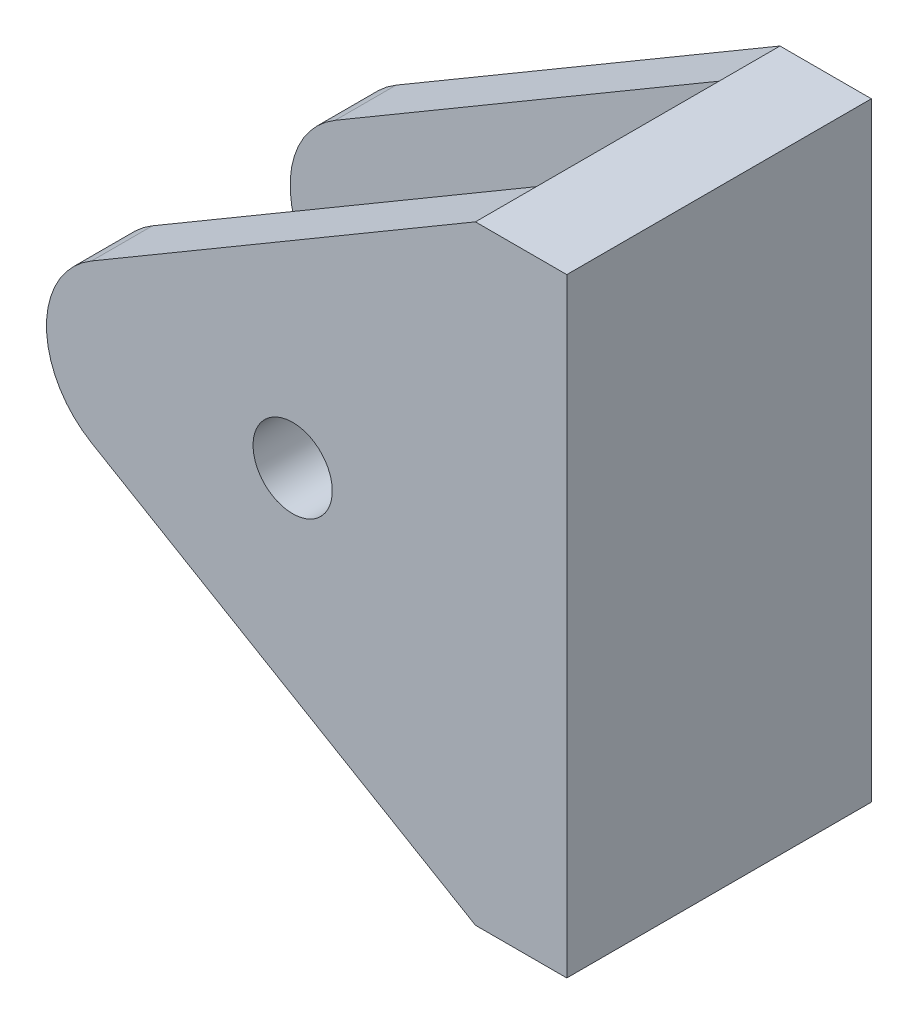
ISO-10303-21;
HEADER;
FILE_DESCRIPTION(('STEP AP214'),'2;1');
FILE_NAME('part.step','',(''),(''),'','','');
FILE_SCHEMA(('AUTOMOTIVE_DESIGN { 1 0 10303 214 1 1 1 1 }'));
ENDSEC;
DATA;
#1=APPLICATION_CONTEXT('core data for automotive mechanical design processes');
#2=APPLICATION_PROTOCOL_DEFINITION('international standard','automotive_design',2000,#1);
#3=PRODUCT_CONTEXT('',#1,'mechanical');
#4=PRODUCT('Part','Part','',(#3));
#5=PRODUCT_RELATED_PRODUCT_CATEGORY('part','',(#4));
#6=PRODUCT_DEFINITION_FORMATION('','',#4);
#7=PRODUCT_DEFINITION_CONTEXT('part definition',#1,'design');
#8=PRODUCT_DEFINITION('design','',#6,#7);
#9=PRODUCT_DEFINITION_SHAPE('','',#8);
#10=(LENGTH_UNIT() NAMED_UNIT(*) SI_UNIT(.MILLI.,.METRE.));
#11=(NAMED_UNIT(*) PLANE_ANGLE_UNIT() SI_UNIT($,.RADIAN.));
#12=(NAMED_UNIT(*) SI_UNIT($,.STERADIAN.) SOLID_ANGLE_UNIT());
#13=UNCERTAINTY_MEASURE_WITH_UNIT(LENGTH_MEASURE(1.E-05),#10,'distance_accuracy_value','');
#14=(GEOMETRIC_REPRESENTATION_CONTEXT(3) GLOBAL_UNCERTAINTY_ASSIGNED_CONTEXT((#13)) GLOBAL_UNIT_ASSIGNED_CONTEXT((#10,
#11,#12)) REPRESENTATION_CONTEXT('',''));
#15=CARTESIAN_POINT('',(0.,0.,0.));
#16=DIRECTION('',(0.,0.,1.));
#17=DIRECTION('',(1.,0.,0.));
#18=AXIS2_PLACEMENT_3D('',#15,#16,#17);
#19=CARTESIAN_POINT('',(-14.0830751230052,0.,0.));
#20=DIRECTION('',(0.,0.,-1.));
#21=DIRECTION('',(-1.,0.,0.));
#22=AXIS2_PLACEMENT_3D('',#19,#20,#21);
#23=PLANE('',#22);
#24=DIRECTION('',(-1.,0.,0.));
#25=VECTOR('',#24,1.);
#26=CARTESIAN_POINT('',(0.,10.,0.));
#27=LINE('',#26,#25);
#28=CARTESIAN_POINT('',(0.,10.,0.));
#29=VERTEX_POINT('',#28);
#30=CARTESIAN_POINT('',(-3.,10.,0.));
#31=VERTEX_POINT('',#30);
#32=EDGE_CURVE('E145',#29,#31,#27,.T.);
#33=ORIENTED_EDGE('',*,*,#32,.F.);
#34=DIRECTION('',(0.,1.,0.));
#35=VECTOR('',#34,1.);
#36=CARTESIAN_POINT('',(0.,-10.,0.));
#37=LINE('',#36,#35);
#38=CARTESIAN_POINT('',(0.,-10.,0.));
#39=VERTEX_POINT('',#38);
#40=EDGE_CURVE('E96',#39,#29,#37,.T.);
#41=ORIENTED_EDGE('',*,*,#40,.F.);
#42=DIRECTION('',(1.,0.,0.));
#43=VECTOR('',#42,1.);
#44=CARTESIAN_POINT('',(0.,-10.,0.));
#45=LINE('',#44,#43);
#46=CARTESIAN_POINT('',(-3.,-10.,0.));
#47=VERTEX_POINT('',#46);
#48=EDGE_CURVE('E158',#47,#39,#45,.T.);
#49=ORIENTED_EDGE('',*,*,#48,.F.);
#50=DIRECTION('',(0.86193421515777,-0.507020126563394,0.));
#51=VECTOR('',#50,1.);
#52=CARTESIAN_POINT('',(-3.,-10.,0.));
#53=LINE('',#52,#51);
#54=CARTESIAN_POINT('',(-15.6041355026954,-2.58580264547331,0.));
#55=VERTEX_POINT('',#54);
#56=EDGE_CURVE('E155',#55,#47,#53,.T.);
#57=ORIENTED_EDGE('',*,*,#56,.F.);
#58=CARTESIAN_POINT('',(-14.0830751230052,0.,0.));
#59=DIRECTION('',(0.,0.,1.));
#60=DIRECTION('',(-1.,0.,0.));
#61=AXIS2_PLACEMENT_3D('',#58,#59,#60);
#62=CIRCLE('',#61,3.);
#63=CARTESIAN_POINT('',(-15.6041355026954,2.58580264547331,0.));
#64=VERTEX_POINT('',#63);
#65=EDGE_CURVE('E152',#64,#55,#62,.T.);
#66=ORIENTED_EDGE('',*,*,#65,.F.);
#67=DIRECTION('',(-0.86193421515777,-0.507020126563394,0.));
#68=VECTOR('',#67,1.);
#69=CARTESIAN_POINT('',(-3.,10.,0.));
#70=LINE('',#69,#68);
#71=EDGE_CURVE('E148',#31,#64,#70,.T.);
#72=ORIENTED_EDGE('',*,*,#71,.F.);
#73=EDGE_LOOP('',(#33,#41,#49,#57,#66,#72));
#74=FACE_BOUND('',#73,.T.);
#75=CARTESIAN_POINT('',(-9.,0.,0.));
#76=DIRECTION('',(0.,0.,-1.));
#77=DIRECTION('',(-1.,0.,0.));
#78=AXIS2_PLACEMENT_3D('',#75,#76,#77);
#79=CIRCLE('',#78,1.29999999999999);
#80=CARTESIAN_POINT('',(-10.3,0.,0.));
#81=VERTEX_POINT('',#80);
#82=EDGE_CURVE('E272',#81,#81,#79,.F.);
#83=ORIENTED_EDGE('',*,*,#82,.T.);
#84=EDGE_LOOP('',(#83));
#85=FACE_BOUND('',#84,.T.);
#86=ADVANCED_FACE('F45',(#74,#85),#23,.T.);
#87=CARTESIAN_POINT('',(-3.,10.,10.));
#88=DIRECTION('',(0.507020126563394,-0.861934215157769,0.));
#89=DIRECTION('',(0.86193421515777,0.507020126563394,0.));
#90=AXIS2_PLACEMENT_3D('',#87,#88,#89);
#91=PLANE('',#90);
#92=DIRECTION('',(-0.86193421515777,-0.507020126563394,0.));
#93=VECTOR('',#92,1.);
#94=CARTESIAN_POINT('',(-3.,10.,2.));
#95=LINE('',#94,#93);
#96=CARTESIAN_POINT('',(-3.00000000000001,10.,2.));
#97=VERTEX_POINT('',#96);
#98=CARTESIAN_POINT('',(-15.6041355026954,2.58580264547331,2.));
#99=VERTEX_POINT('',#98);
#100=EDGE_CURVE('E149',#97,#99,#95,.T.);
#101=ORIENTED_EDGE('',*,*,#100,.F.);
#102=DIRECTION('',(0.,0.,-1.));
#103=VECTOR('',#102,1.);
#104=CARTESIAN_POINT('',(-3.,10.,10.));
#105=LINE('',#104,#103);
#106=EDGE_CURVE('E170',#97,#31,#105,.T.);
#107=ORIENTED_EDGE('',*,*,#106,.T.);
#108=ORIENTED_EDGE('',*,*,#71,.T.);
#109=DIRECTION('',(0.,0.,-1.));
#110=VECTOR('',#109,1.);
#111=CARTESIAN_POINT('',(-15.6041355026954,2.58580264547331,10.));
#112=LINE('',#111,#110);
#113=EDGE_CURVE('E166',#99,#64,#112,.T.);
#114=ORIENTED_EDGE('',*,*,#113,.F.);
#115=EDGE_LOOP('',(#101,#107,#108,#114));
#116=FACE_BOUND('',#115,.T.);
#117=ADVANCED_FACE('F218',(#116),#91,.F.);
#118=DIRECTION('',(0.86193421515777,0.507020126563394,0.));
#119=VECTOR('',#118,1.);
#120=CARTESIAN_POINT('',(-3.,10.,8.));
#121=LINE('',#120,#119);
#122=CARTESIAN_POINT('',(-15.6041355026954,2.58580264547331,8.));
#123=VERTEX_POINT('',#122);
#124=CARTESIAN_POINT('',(-3.00000000000001,10.,8.));
#125=VERTEX_POINT('',#124);
#126=EDGE_CURVE('E188',#123,#125,#121,.T.);
#127=ORIENTED_EDGE('',*,*,#126,.F.);
#128=CARTESIAN_POINT('',(-15.6041355026954,2.58580264547331,10.));
#129=VERTEX_POINT('',#128);
#130=EDGE_CURVE('E167',#129,#123,#112,.T.);
#131=ORIENTED_EDGE('',*,*,#130,.F.);
#132=DIRECTION('',(-0.86193421515777,-0.507020126563394,0.));
#133=VECTOR('',#132,1.);
#134=CARTESIAN_POINT('',(-3.,10.,10.));
#135=LINE('',#134,#133);
#136=CARTESIAN_POINT('',(-3.,10.,10.));
#137=VERTEX_POINT('',#136);
#138=EDGE_CURVE('E105',#137,#129,#135,.T.);
#139=ORIENTED_EDGE('',*,*,#138,.F.);
#140=EDGE_CURVE('E171',#137,#125,#105,.T.);
#141=ORIENTED_EDGE('',*,*,#140,.T.);
#142=EDGE_LOOP('',(#127,#131,#139,#141));
#143=FACE_BOUND('',#142,.T.);
#144=ADVANCED_FACE('F204',(#143),#91,.F.);
#145=CARTESIAN_POINT('',(-14.0830751230052,0.,10.));
#146=DIRECTION('',(0.,0.,-1.));
#147=DIRECTION('',(-1.,0.,0.));
#148=AXIS2_PLACEMENT_3D('',#145,#146,#147);
#149=CYLINDRICAL_SURFACE('',#148,3.);
#150=CARTESIAN_POINT('',(-14.0830751230052,0.,2.));
#151=DIRECTION('',(0.,0.,1.));
#152=DIRECTION('',(0.,-1.,0.));
#153=AXIS2_PLACEMENT_3D('',#150,#151,#152);
#154=CIRCLE('',#153,3.);
#155=CARTESIAN_POINT('',(-15.6041355026954,-2.58580264547331,2.));
#156=VERTEX_POINT('',#155);
#157=EDGE_CURVE('E191',#99,#156,#154,.T.);
#158=ORIENTED_EDGE('',*,*,#157,.F.);
#159=ORIENTED_EDGE('',*,*,#113,.T.);
#160=ORIENTED_EDGE('',*,*,#65,.T.);
#161=DIRECTION('',(0.,0.,-1.));
#162=VECTOR('',#161,1.);
#163=CARTESIAN_POINT('',(-15.6041355026954,-2.58580264547331,10.));
#164=LINE('',#163,#162);
#165=EDGE_CURVE('E134',#156,#55,#164,.T.);
#166=ORIENTED_EDGE('',*,*,#165,.F.);
#167=EDGE_LOOP('',(#158,#159,#160,#166));
#168=FACE_BOUND('',#167,.T.);
#169=ADVANCED_FACE('F228',(#168),#149,.T.);
#170=CARTESIAN_POINT('',(-14.0830751230052,0.,8.));
#171=DIRECTION('',(0.,0.,-1.));
#172=DIRECTION('',(0.,1.,0.));
#173=AXIS2_PLACEMENT_3D('',#170,#171,#172);
#174=CIRCLE('',#173,3.);
#175=CARTESIAN_POINT('',(-15.6041355026954,-2.58580264547331,8.));
#176=VERTEX_POINT('',#175);
#177=EDGE_CURVE('E181',#176,#123,#174,.T.);
#178=ORIENTED_EDGE('',*,*,#177,.F.);
#179=CARTESIAN_POINT('',(-15.6041355026954,-2.58580264547331,10.));
#180=VERTEX_POINT('',#179);
#181=EDGE_CURVE('E164',#180,#176,#164,.T.);
#182=ORIENTED_EDGE('',*,*,#181,.F.);
#183=CARTESIAN_POINT('',(-14.0830751230052,0.,10.));
#184=DIRECTION('',(0.,0.,1.));
#185=DIRECTION('',(-1.,0.,0.));
#186=AXIS2_PLACEMENT_3D('',#183,#184,#185);
#187=CIRCLE('',#186,3.);
#188=EDGE_CURVE('E121',#129,#180,#187,.T.);
#189=ORIENTED_EDGE('',*,*,#188,.F.);
#190=ORIENTED_EDGE('',*,*,#130,.T.);
#191=EDGE_LOOP('',(#178,#182,#189,#190));
#192=FACE_BOUND('',#191,.T.);
#193=ADVANCED_FACE('F187',(#192),#149,.T.);
#194=CARTESIAN_POINT('',(-3.,-10.,10.));
#195=DIRECTION('',(0.507020126563394,0.861934215157769,0.));
#196=DIRECTION('',(-0.86193421515777,0.507020126563394,0.));
#197=AXIS2_PLACEMENT_3D('',#194,#195,#196);
#198=PLANE('',#197);
#199=DIRECTION('',(0.86193421515777,-0.507020126563394,0.));
#200=VECTOR('',#199,1.);
#201=CARTESIAN_POINT('',(-3.,-10.,2.));
#202=LINE('',#201,#200);
#203=CARTESIAN_POINT('',(-3.,-10.,2.));
#204=VERTEX_POINT('',#203);
#205=EDGE_CURVE('E11',#156,#204,#202,.T.);
#206=ORIENTED_EDGE('',*,*,#205,.F.);
#207=ORIENTED_EDGE('',*,*,#165,.T.);
#208=ORIENTED_EDGE('',*,*,#56,.T.);
#209=DIRECTION('',(0.,0.,-1.));
#210=VECTOR('',#209,1.);
#211=CARTESIAN_POINT('',(-3.,-10.,10.));
#212=LINE('',#211,#210);
#213=EDGE_CURVE('E137',#204,#47,#212,.T.);
#214=ORIENTED_EDGE('',*,*,#213,.F.);
#215=EDGE_LOOP('',(#206,#207,#208,#214));
#216=FACE_BOUND('',#215,.T.);
#217=ADVANCED_FACE('F235',(#216),#198,.F.);
#218=DIRECTION('',(-0.86193421515777,0.507020126563394,0.));
#219=VECTOR('',#218,1.);
#220=CARTESIAN_POINT('',(-3.,-10.,8.));
#221=LINE('',#220,#219);
#222=CARTESIAN_POINT('',(-3.,-10.,8.));
#223=VERTEX_POINT('',#222);
#224=EDGE_CURVE('E54',#223,#176,#221,.T.);
#225=ORIENTED_EDGE('',*,*,#224,.F.);
#226=CARTESIAN_POINT('',(-3.,-10.,10.));
#227=VERTEX_POINT('',#226);
#228=EDGE_CURVE('E128',#227,#223,#212,.T.);
#229=ORIENTED_EDGE('',*,*,#228,.F.);
#230=DIRECTION('',(0.86193421515777,-0.507020126563394,0.));
#231=VECTOR('',#230,1.);
#232=CARTESIAN_POINT('',(-3.,-10.,10.));
#233=LINE('',#232,#231);
#234=EDGE_CURVE('E114',#180,#227,#233,.T.);
#235=ORIENTED_EDGE('',*,*,#234,.F.);
#236=ORIENTED_EDGE('',*,*,#181,.T.);
#237=EDGE_LOOP('',(#225,#229,#235,#236));
#238=FACE_BOUND('',#237,.T.);
#239=ADVANCED_FACE('F129',(#238),#198,.F.);
#240=CARTESIAN_POINT('',(0.,10.,10.));
#241=DIRECTION('',(0.,-1.,0.));
#242=DIRECTION('',(0.,0.,-1.));
#243=AXIS2_PLACEMENT_3D('',#240,#241,#242);
#244=PLANE('',#243);
#245=ORIENTED_EDGE('',*,*,#32,.T.);
#246=ORIENTED_EDGE('',*,*,#106,.F.);
#247=DIRECTION('',(0.,0.,1.));
#248=VECTOR('',#247,1.);
#249=CARTESIAN_POINT('',(-3.,10.,10.));
#250=LINE('',#249,#248);
#251=EDGE_CURVE('E189',#97,#125,#250,.T.);
#252=ORIENTED_EDGE('',*,*,#251,.T.);
#253=ORIENTED_EDGE('',*,*,#140,.F.);
#254=DIRECTION('',(-1.,0.,0.));
#255=VECTOR('',#254,1.);
#256=CARTESIAN_POINT('',(0.,10.,10.));
#257=LINE('',#256,#255);
#258=CARTESIAN_POINT('',(0.,10.,10.));
#259=VERTEX_POINT('',#258);
#260=EDGE_CURVE('E161',#259,#137,#257,.T.);
#261=ORIENTED_EDGE('',*,*,#260,.F.);
#262=DIRECTION('',(0.,0.,-1.));
#263=VECTOR('',#262,1.);
#264=CARTESIAN_POINT('',(0.,10.,10.));
#265=LINE('',#264,#263);
#266=EDGE_CURVE('E141',#259,#29,#265,.T.);
#267=ORIENTED_EDGE('',*,*,#266,.T.);
#268=EDGE_LOOP('',(#245,#246,#252,#253,#261,#267));
#269=FACE_BOUND('',#268,.T.);
#270=ADVANCED_FACE('F47',(#269),#244,.F.);
#271=CARTESIAN_POINT('',(0.,-10.,10.));
#272=DIRECTION('',(0.,1.,0.));
#273=DIRECTION('',(0.,0.,1.));
#274=AXIS2_PLACEMENT_3D('',#271,#272,#273);
#275=PLANE('',#274);
#276=ORIENTED_EDGE('',*,*,#48,.T.);
#277=DIRECTION('',(0.,0.,-1.));
#278=VECTOR('',#277,1.);
#279=CARTESIAN_POINT('',(0.,-10.,10.));
#280=LINE('',#279,#278);
#281=CARTESIAN_POINT('',(0.,-10.,10.));
#282=VERTEX_POINT('',#281);
#283=EDGE_CURVE('E139',#282,#39,#280,.T.);
#284=ORIENTED_EDGE('',*,*,#283,.F.);
#285=DIRECTION('',(1.,0.,0.));
#286=VECTOR('',#285,1.);
#287=CARTESIAN_POINT('',(0.,-10.,10.));
#288=LINE('',#287,#286);
#289=EDGE_CURVE('E118',#227,#282,#288,.T.);
#290=ORIENTED_EDGE('',*,*,#289,.F.);
#291=ORIENTED_EDGE('',*,*,#228,.T.);
#292=EDGE_CURVE('E135',#223,#204,#212,.T.);
#293=ORIENTED_EDGE('',*,*,#292,.T.);
#294=ORIENTED_EDGE('',*,*,#213,.T.);
#295=EDGE_LOOP('',(#276,#284,#290,#291,#293,#294));
#296=FACE_BOUND('',#295,.T.);
#297=ADVANCED_FACE('F138',(#296),#275,.F.);
#298=CARTESIAN_POINT('',(0.,-10.,10.));
#299=DIRECTION('',(-1.,0.,0.));
#300=DIRECTION('',(0.,-1.,0.));
#301=AXIS2_PLACEMENT_3D('',#298,#299,#300);
#302=PLANE('',#301);
#303=ORIENTED_EDGE('',*,*,#40,.T.);
#304=ORIENTED_EDGE('',*,*,#266,.F.);
#305=DIRECTION('',(0.,1.,0.));
#306=VECTOR('',#305,1.);
#307=CARTESIAN_POINT('',(0.,-10.,10.));
#308=LINE('',#307,#306);
#309=EDGE_CURVE('E69',#282,#259,#308,.T.);
#310=ORIENTED_EDGE('',*,*,#309,.F.);
#311=ORIENTED_EDGE('',*,*,#283,.T.);
#312=EDGE_LOOP('',(#303,#304,#310,#311));
#313=FACE_BOUND('',#312,.T.);
#314=ADVANCED_FACE('F236',(#313),#302,.F.);
#315=CARTESIAN_POINT('',(-14.0830751230052,0.,10.));
#316=DIRECTION('',(0.,0.,-1.));
#317=DIRECTION('',(-1.,0.,0.));
#318=AXIS2_PLACEMENT_3D('',#315,#316,#317);
#319=PLANE('',#318);
#320=CARTESIAN_POINT('',(-9.,0.,10.));
#321=DIRECTION('',(0.,0.,1.));
#322=DIRECTION('',(1.,0.,0.));
#323=AXIS2_PLACEMENT_3D('',#320,#321,#322);
#324=CIRCLE('',#323,1.29999999999999);
#325=CARTESIAN_POINT('',(-7.70000000000001,0.,10.));
#326=VERTEX_POINT('',#325);
#327=EDGE_CURVE('E271',#326,#326,#324,.T.);
#328=ORIENTED_EDGE('',*,*,#327,.F.);
#329=EDGE_LOOP('',(#328));
#330=FACE_BOUND('',#329,.T.);
#331=ORIENTED_EDGE('',*,*,#260,.T.);
#332=ORIENTED_EDGE('',*,*,#138,.T.);
#333=ORIENTED_EDGE('',*,*,#188,.T.);
#334=ORIENTED_EDGE('',*,*,#234,.T.);
#335=ORIENTED_EDGE('',*,*,#289,.T.);
#336=ORIENTED_EDGE('',*,*,#309,.T.);
#337=EDGE_LOOP('',(#331,#332,#333,#334,#335,#336));
#338=FACE_BOUND('',#337,.T.);
#339=ADVANCED_FACE('F116',(#330,#338),#319,.F.);
#340=CARTESIAN_POINT('',(-3.00000000000001,12.456927681102,2.));
#341=DIRECTION('',(0.,0.,1.));
#342=DIRECTION('',(0.,-1.,0.));
#343=AXIS2_PLACEMENT_3D('',#340,#341,#342);
#344=PLANE('',#343);
#345=CARTESIAN_POINT('',(-9.,0.,2.));
#346=DIRECTION('',(0.,0.,1.));
#347=DIRECTION('',(0.,-1.,0.));
#348=AXIS2_PLACEMENT_3D('',#345,#346,#347);
#349=CIRCLE('',#348,1.29999999999999);
#350=CARTESIAN_POINT('',(-9.,-1.29999999999999,2.));
#351=VERTEX_POINT('',#350);
#352=EDGE_CURVE('E277',#351,#351,#349,.T.);
#353=ORIENTED_EDGE('',*,*,#352,.F.);
#354=EDGE_LOOP('',(#353));
#355=FACE_BOUND('',#354,.T.);
#356=ORIENTED_EDGE('',*,*,#100,.T.);
#357=ORIENTED_EDGE('',*,*,#157,.T.);
#358=ORIENTED_EDGE('',*,*,#205,.T.);
#359=DIRECTION('',(0.,1.,0.));
#360=VECTOR('',#359,1.);
#361=CARTESIAN_POINT('',(-3.00000000000001,12.456927681102,2.));
#362=LINE('',#361,#360);
#363=EDGE_CURVE('E61',#204,#97,#362,.T.);
#364=ORIENTED_EDGE('',*,*,#363,.T.);
#365=EDGE_LOOP('',(#356,#357,#358,#364));
#366=FACE_BOUND('',#365,.T.);
#367=ADVANCED_FACE('F232',(#355,#366),#344,.T.);
#368=CARTESIAN_POINT('',(-3.00000000000001,12.456927681102,8.));
#369=DIRECTION('',(0.,0.,-1.));
#370=DIRECTION('',(0.,1.,0.));
#371=AXIS2_PLACEMENT_3D('',#368,#369,#370);
#372=PLANE('',#371);
#373=CARTESIAN_POINT('',(-9.,0.,8.));
#374=DIRECTION('',(0.,0.,-1.));
#375=DIRECTION('',(0.,1.,0.));
#376=AXIS2_PLACEMENT_3D('',#373,#374,#375);
#377=CIRCLE('',#376,1.29999999999999);
#378=CARTESIAN_POINT('',(-9.,1.29999999999999,8.));
#379=VERTEX_POINT('',#378);
#380=EDGE_CURVE('E49',#379,#379,#377,.T.);
#381=ORIENTED_EDGE('',*,*,#380,.F.);
#382=EDGE_LOOP('',(#381));
#383=FACE_BOUND('',#382,.T.);
#384=ORIENTED_EDGE('',*,*,#126,.T.);
#385=DIRECTION('',(0.,-1.,0.));
#386=VECTOR('',#385,1.);
#387=CARTESIAN_POINT('',(-3.00000000000001,12.456927681102,8.));
#388=LINE('',#387,#386);
#389=EDGE_CURVE('E184',#125,#223,#388,.T.);
#390=ORIENTED_EDGE('',*,*,#389,.T.);
#391=ORIENTED_EDGE('',*,*,#224,.T.);
#392=ORIENTED_EDGE('',*,*,#177,.T.);
#393=EDGE_LOOP('',(#384,#390,#391,#392));
#394=FACE_BOUND('',#393,.T.);
#395=ADVANCED_FACE('F179',(#383,#394),#372,.T.);
#396=CARTESIAN_POINT('',(-3.00000000000001,0.,0.));
#397=DIRECTION('',(1.,0.,0.));
#398=DIRECTION('',(0.,1.,0.));
#399=AXIS2_PLACEMENT_3D('',#396,#397,#398);
#400=PLANE('',#399);
#401=ORIENTED_EDGE('',*,*,#363,.F.);
#402=ORIENTED_EDGE('',*,*,#292,.F.);
#403=ORIENTED_EDGE('',*,*,#389,.F.);
#404=ORIENTED_EDGE('',*,*,#251,.F.);
#405=EDGE_LOOP('',(#401,#402,#403,#404));
#406=FACE_BOUND('',#405,.T.);
#407=ADVANCED_FACE('F210',(#406),#400,.F.);
#408=CARTESIAN_POINT('',(-9.,0.,10.));
#409=DIRECTION('',(0.,0.,1.));
#410=DIRECTION('',(1.,0.,0.));
#411=AXIS2_PLACEMENT_3D('',#408,#409,#410);
#412=CYLINDRICAL_SURFACE('',#411,1.29999999999999);
#413=ORIENTED_EDGE('',*,*,#380,.T.);
#414=EDGE_LOOP('',(#413));
#415=FACE_BOUND('',#414,.T.);
#416=ORIENTED_EDGE('',*,*,#327,.T.);
#417=EDGE_LOOP('',(#416));
#418=FACE_BOUND('',#417,.T.);
#419=ADVANCED_FACE('F260',(#415,#418),#412,.F.);
#420=ORIENTED_EDGE('',*,*,#352,.T.);
#421=EDGE_LOOP('',(#420));
#422=FACE_BOUND('',#421,.T.);
#423=ORIENTED_EDGE('',*,*,#82,.F.);
#424=EDGE_LOOP('',(#423));
#425=FACE_BOUND('',#424,.T.);
#426=ADVANCED_FACE('F262',(#422,#425),#412,.F.);
#427=CLOSED_SHELL('',(#86,#117,#144,#169,#193,#217,#239,#270,#297,#314,#339,#367,#395,#407,#419,#426));
#428=MANIFOLD_SOLID_BREP('B2',#427);
#429=ADVANCED_BREP_SHAPE_REPRESENTATION('',(#18,#428),#14);
#430=SHAPE_DEFINITION_REPRESENTATION(#9,#429);
ENDSEC;
END-ISO-10303-21;
